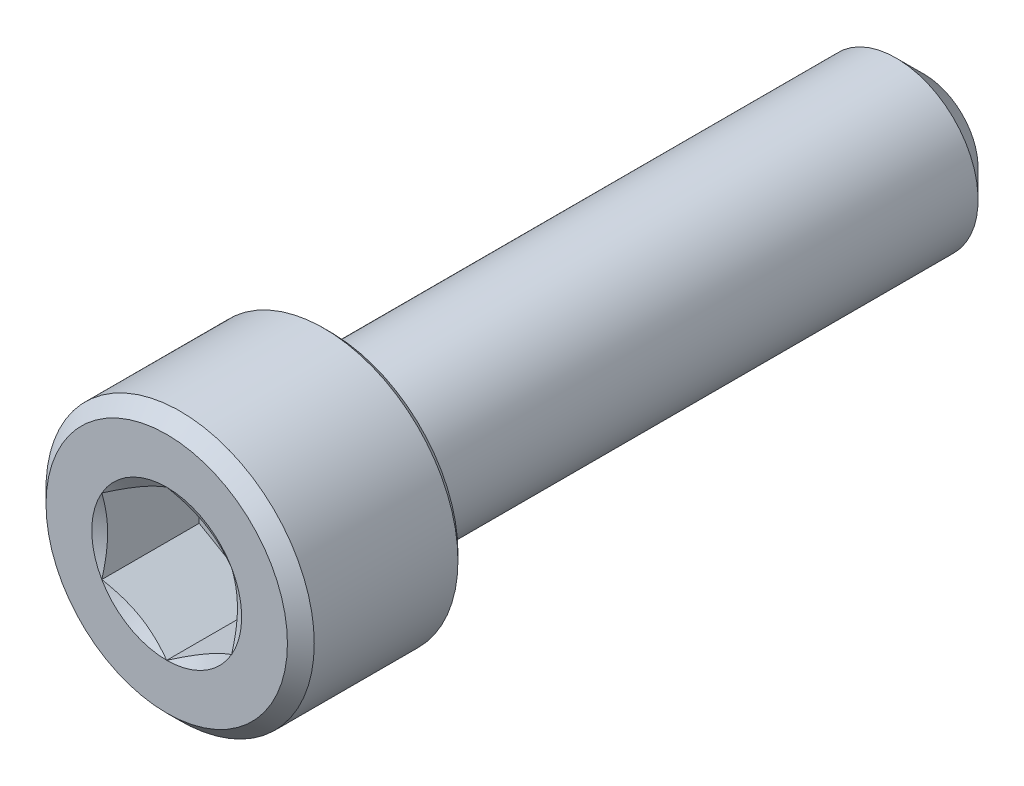
ISO-10303-21;
HEADER;
FILE_DESCRIPTION(('STEP AP214'),'2;1');
FILE_NAME('part.step','',(''),(''),'','','');
FILE_SCHEMA(('AUTOMOTIVE_DESIGN { 1 0 10303 214 1 1 1 1 }'));
ENDSEC;
DATA;
#1=APPLICATION_CONTEXT('core data for automotive mechanical design processes');
#2=APPLICATION_PROTOCOL_DEFINITION('international standard','automotive_design',2000,#1);
#3=PRODUCT_CONTEXT('',#1,'mechanical');
#4=PRODUCT('Part','Part','',(#3));
#5=PRODUCT_RELATED_PRODUCT_CATEGORY('part','',(#4));
#6=PRODUCT_DEFINITION_FORMATION('','',#4);
#7=PRODUCT_DEFINITION_CONTEXT('part definition',#1,'design');
#8=PRODUCT_DEFINITION('design','',#6,#7);
#9=PRODUCT_DEFINITION_SHAPE('','',#8);
#10=(LENGTH_UNIT() NAMED_UNIT(*) SI_UNIT(.MILLI.,.METRE.));
#11=(NAMED_UNIT(*) PLANE_ANGLE_UNIT() SI_UNIT($,.RADIAN.));
#12=(NAMED_UNIT(*) SI_UNIT($,.STERADIAN.) SOLID_ANGLE_UNIT());
#13=UNCERTAINTY_MEASURE_WITH_UNIT(LENGTH_MEASURE(1.E-05),#10,'distance_accuracy_value','');
#14=(GEOMETRIC_REPRESENTATION_CONTEXT(3) GLOBAL_UNCERTAINTY_ASSIGNED_CONTEXT((#13)) GLOBAL_UNIT_ASSIGNED_CONTEXT((#10,
#11,#12)) REPRESENTATION_CONTEXT('',''));
#15=CARTESIAN_POINT('',(0.,0.,0.));
#16=DIRECTION('',(0.,0.,1.));
#17=DIRECTION('',(1.,0.,0.));
#18=AXIS2_PLACEMENT_3D('',#15,#16,#17);
#19=CARTESIAN_POINT('',(0.,2.8702,8.1026));
#20=DIRECTION('',(0.,0.,1.));
#21=DIRECTION('',(1.,0.,0.));
#22=AXIS2_PLACEMENT_3D('',#19,#20,#21);
#23=PLANE('',#22);
#24=CARTESIAN_POINT('',(0.,0.,8.1026));
#25=DIRECTION('',(0.,0.,1.));
#26=DIRECTION('',(1.,0.,0.));
#27=AXIS2_PLACEMENT_3D('',#24,#25,#26);
#28=CIRCLE('',#27,2.58318);
#29=CARTESIAN_POINT('',(2.58318,0.,8.1026));
#30=VERTEX_POINT('',#29);
#31=EDGE_CURVE('E169',#30,#30,#28,.T.);
#32=ORIENTED_EDGE('',*,*,#31,.T.);
#33=EDGE_LOOP('',(#32));
#34=FACE_BOUND('',#33,.T.);
#35=CARTESIAN_POINT('',(0.,0.,8.1026));
#36=DIRECTION('',(0.,0.,1.));
#37=DIRECTION('',(1.,0.,0.));
#38=AXIS2_PLACEMENT_3D('',#35,#36,#37);
#39=CIRCLE('',#38,1.60395121659243);
#40=CARTESIAN_POINT('',(1.3890625,0.801975608296212,8.1026));
#41=VERTEX_POINT('',#40);
#42=CARTESIAN_POINT('',(0.,1.60395121659243,8.1026));
#43=VERTEX_POINT('',#42);
#44=EDGE_CURVE('E87',#41,#43,#39,.T.);
#45=ORIENTED_EDGE('',*,*,#44,.F.);
#46=CARTESIAN_POINT('',(1.3890625,-0.801975608296215,8.1026));
#47=VERTEX_POINT('',#46);
#48=EDGE_CURVE('E47',#47,#41,#39,.T.);
#49=ORIENTED_EDGE('',*,*,#48,.F.);
#50=CARTESIAN_POINT('',(0.,-1.60395121659243,8.1026));
#51=VERTEX_POINT('',#50);
#52=EDGE_CURVE('E274',#51,#47,#39,.T.);
#53=ORIENTED_EDGE('',*,*,#52,.F.);
#54=CARTESIAN_POINT('',(-1.3890625,-0.801975608296218,8.1026));
#55=VERTEX_POINT('',#54);
#56=EDGE_CURVE('E54',#55,#51,#39,.T.);
#57=ORIENTED_EDGE('',*,*,#56,.F.);
#58=CARTESIAN_POINT('',(-1.3890625,0.801975608296215,8.1026));
#59=VERTEX_POINT('',#58);
#60=EDGE_CURVE('E127',#59,#55,#39,.T.);
#61=ORIENTED_EDGE('',*,*,#60,.F.);
#62=EDGE_CURVE('E96',#43,#59,#39,.T.);
#63=ORIENTED_EDGE('',*,*,#62,.F.);
#64=EDGE_LOOP('',(#45,#49,#53,#57,#61,#63));
#65=FACE_BOUND('',#64,.T.);
#66=ADVANCED_FACE('F33',(#34,#65),#23,.T.);
#67=CARTESIAN_POINT('',(0.,0.,-8.1026));
#68=DIRECTION('',(0.,0.,-1.));
#69=DIRECTION('',(-1.,0.,0.));
#70=AXIS2_PLACEMENT_3D('',#67,#68,#69);
#71=CYLINDRICAL_SURFACE('',#70,2.8702);
#72=CARTESIAN_POINT('',(0.,0.,4.74091));
#73=DIRECTION('',(0.,0.,-1.));
#74=DIRECTION('',(-1.,0.,0.));
#75=AXIS2_PLACEMENT_3D('',#72,#73,#74);
#76=CIRCLE('',#75,2.8702);
#77=CARTESIAN_POINT('',(2.8702,0.,4.74091));
#78=VERTEX_POINT('',#77);
#79=EDGE_CURVE('E11',#78,#78,#76,.F.);
#80=ORIENTED_EDGE('',*,*,#79,.T.);
#81=EDGE_LOOP('',(#80));
#82=FACE_BOUND('',#81,.T.);
#83=CARTESIAN_POINT('',(0.,0.,7.81558));
#84=DIRECTION('',(0.,0.,1.));
#85=DIRECTION('',(1.,0.,0.));
#86=AXIS2_PLACEMENT_3D('',#83,#84,#85);
#87=CIRCLE('',#86,2.8702);
#88=CARTESIAN_POINT('',(2.8702,0.,7.81558));
#89=VERTEX_POINT('',#88);
#90=EDGE_CURVE('E106',#89,#89,#87,.F.);
#91=ORIENTED_EDGE('',*,*,#90,.T.);
#92=EDGE_LOOP('',(#91));
#93=FACE_BOUND('',#92,.T.);
#94=ADVANCED_FACE('F186',(#82,#93),#71,.T.);
#95=CARTESIAN_POINT('',(0.,2.8702,4.5974));
#96=DIRECTION('',(0.,0.,-1.));
#97=DIRECTION('',(-1.,0.,0.));
#98=AXIS2_PLACEMENT_3D('',#95,#96,#97);
#99=PLANE('',#98);
#100=CARTESIAN_POINT('',(0.,0.,4.5974));
#101=DIRECTION('',(0.,0.,-1.));
#102=DIRECTION('',(-1.,0.,0.));
#103=AXIS2_PLACEMENT_3D('',#100,#101,#102);
#104=CIRCLE('',#103,2.72668999999999);
#105=CARTESIAN_POINT('',(2.72668999999999,0.,4.5974));
#106=VERTEX_POINT('',#105);
#107=EDGE_CURVE('E41',#106,#106,#104,.T.);
#108=ORIENTED_EDGE('',*,*,#107,.T.);
#109=EDGE_LOOP('',(#108));
#110=FACE_BOUND('',#109,.T.);
#111=CARTESIAN_POINT('',(0.,0.,4.5974));
#112=DIRECTION('',(0.,0.,-1.));
#113=DIRECTION('',(-1.,0.,0.));
#114=AXIS2_PLACEMENT_3D('',#111,#112,#113);
#115=CIRCLE('',#114,1.7526);
#116=CARTESIAN_POINT('',(-1.7526,0.,4.5974));
#117=VERTEX_POINT('',#116);
#118=EDGE_CURVE('E107',#117,#117,#115,.T.);
#119=ORIENTED_EDGE('',*,*,#118,.F.);
#120=EDGE_LOOP('',(#119));
#121=FACE_BOUND('',#120,.T.);
#122=ADVANCED_FACE('F174',(#110,#121),#99,.T.);
#123=CARTESIAN_POINT('',(0.,0.,-8.1026));
#124=DIRECTION('',(0.,0.,-1.));
#125=DIRECTION('',(-1.,0.,0.));
#126=AXIS2_PLACEMENT_3D('',#123,#124,#125);
#127=CYLINDRICAL_SURFACE('',#126,1.7526);
#128=ORIENTED_EDGE('',*,*,#118,.T.);
#129=EDGE_LOOP('',(#128));
#130=FACE_BOUND('',#129,.T.);
#131=CARTESIAN_POINT('',(0.,0.,-7.5072875));
#132=DIRECTION('',(0.,0.,-1.));
#133=DIRECTION('',(-1.,0.,0.));
#134=AXIS2_PLACEMENT_3D('',#131,#132,#133);
#135=CIRCLE('',#134,1.7526);
#136=CARTESIAN_POINT('',(-1.7526,0.,-7.5072875));
#137=VERTEX_POINT('',#136);
#138=EDGE_CURVE('E215',#137,#137,#135,.T.);
#139=ORIENTED_EDGE('',*,*,#138,.F.);
#140=EDGE_LOOP('',(#139));
#141=FACE_BOUND('',#140,.T.);
#142=ADVANCED_FACE('F197',(#130,#141),#127,.T.);
#143=CARTESIAN_POINT('',(0.,0.,-8.1026));
#144=DIRECTION('',(0.,0.,1.));
#145=DIRECTION('',(1.,0.,0.));
#146=AXIS2_PLACEMENT_3D('',#143,#144,#145);
#147=CONICAL_SURFACE('',#146,1.1572875,0.785398163397443);
#148=ORIENTED_EDGE('',*,*,#138,.T.);
#149=EDGE_LOOP('',(#148));
#150=FACE_BOUND('',#149,.T.);
#151=CARTESIAN_POINT('',(0.,0.,-8.1026));
#152=DIRECTION('',(0.,0.,-1.));
#153=DIRECTION('',(-1.,0.,0.));
#154=AXIS2_PLACEMENT_3D('',#151,#152,#153);
#155=CIRCLE('',#154,1.1572875);
#156=CARTESIAN_POINT('',(-1.1572875,0.,-8.1026));
#157=VERTEX_POINT('',#156);
#158=EDGE_CURVE('E213',#157,#157,#155,.T.);
#159=ORIENTED_EDGE('',*,*,#158,.F.);
#160=EDGE_LOOP('',(#159));
#161=FACE_BOUND('',#160,.T.);
#162=ADVANCED_FACE('F200',(#150,#161),#147,.T.);
#163=CARTESIAN_POINT('',(0.,1.1572875,-8.1026));
#164=DIRECTION('',(0.,0.,-1.));
#165=DIRECTION('',(-1.,0.,0.));
#166=AXIS2_PLACEMENT_3D('',#163,#164,#165);
#167=PLANE('',#166);
#168=ORIENTED_EDGE('',*,*,#158,.T.);
#169=EDGE_LOOP('',(#168));
#170=FACE_BOUND('',#169,.T.);
#171=ADVANCED_FACE('F203',(#170),#167,.T.);
#172=CARTESIAN_POINT('',(0.,0.,8.1026));
#173=DIRECTION('',(0.,0.,1.));
#174=DIRECTION('',(1.,0.,0.));
#175=AXIS2_PLACEMENT_3D('',#172,#173,#174);
#176=CONICAL_SURFACE('',#175,1.60395121659243,1.0471975511966);
#177=ORIENTED_EDGE('',*,*,#62,.T.);
#178=CARTESIAN_POINT('',(0.000199999999999313,1.60406668664627,8.10266667386525));
#179=CARTESIAN_POINT('',(-0.0608442598690744,1.56882276677837,8.08230833857433));
#180=CARTESIAN_POINT('',(-0.122415445452366,1.53327462620754,8.0637926618312));
#181=CARTESIAN_POINT('',(-0.246624155605557,1.4615626939649,8.03147218472764));
#182=CARTESIAN_POINT('',(-0.309263888443662,1.42539762734885,8.01767882019906));
#183=CARTESIAN_POINT('',(-0.433766989921787,1.35351572819551,7.99620582768478));
#184=CARTESIAN_POINT('',(-0.495611193785563,1.31780996044694,7.98838331289986));
#185=CARTESIAN_POINT('',(-0.619590843813121,1.2462302761295,7.97904206929091));
#186=CARTESIAN_POINT('',(-0.681725838849018,1.21035662001942,7.97751560806186));
#187=CARTESIAN_POINT('',(-0.797844772079228,1.14331532266095,7.98067825862487));
#188=CARTESIAN_POINT('',(-0.851846025654005,1.11213768437298,7.98459082852922));
#189=CARTESIAN_POINT('',(-0.959496687442052,1.04998554581121,7.99699539372162));
#190=CARTESIAN_POINT('',(-1.01314572285493,1.01901126077382,8.00549163315096));
#191=CARTESIAN_POINT('',(-1.1210186357574,0.956730805471307,8.02673315397272));
#192=CARTESIAN_POINT('',(-1.17522884873762,0.92543252441435,8.0395685459783));
#193=CARTESIAN_POINT('',(-1.28284038683134,0.863302973928032,8.0687004444726));
#194=CARTESIAN_POINT('',(-1.33624309237207,0.832470907508634,8.08499009865837));
#195=CARTESIAN_POINT('',(-1.3892625,0.801860138242376,8.10266667386525));
#196=B_SPLINE_CURVE_WITH_KNOTS('',3,(#178,#179,#180,#181,#182,#183,#184,#185,#186,#187,#188,
#189,#190,#191,#192,#193,#194,#195),.UNSPECIFIED.,.F.,.F.,(4,2,2,2,2,2,2,2,4),(0.,
0.220193340404853,0.440916203543968,0.656175317558365,0.87116998541587,1.05842536263795,
1.24585442291107,1.43744291582434,1.62865484718206),.UNSPECIFIED.);
#197=EDGE_CURVE('E101',#43,#59,#196,.T.);
#198=ORIENTED_EDGE('',*,*,#197,.F.);
#199=EDGE_LOOP('',(#177,#198));
#200=FACE_BOUND('',#199,.T.);
#201=ADVANCED_FACE('F102',(#200),#176,.F.);
#202=ORIENTED_EDGE('',*,*,#60,.T.);
#203=CARTESIAN_POINT('',(-1.3890625,-2.07685002024154,8.61910245576466));
#204=CARTESIAN_POINT('',(-1.3890625,-2.01686543526765,8.59032411178202));
#205=CARTESIAN_POINT('',(-1.3890625,-1.95673484303842,8.56184475619254));
#206=CARTESIAN_POINT('',(-1.3890625,-1.83610351402459,8.50565344287182));
#207=CARTESIAN_POINT('',(-1.3890625,-1.77560271298754,8.47794162324606));
#208=CARTESIAN_POINT('',(-1.3890625,-1.6538059414698,8.42329998978084));
#209=CARTESIAN_POINT('',(-1.3890625,-1.5925073736981,8.39637593932212));
#210=CARTESIAN_POINT('',(-1.3890625,-1.46939685735004,8.34373577242147));
#211=CARTESIAN_POINT('',(-1.3890625,-1.40758493566438,8.31801959317222));
#212=CARTESIAN_POINT('',(-1.3890625,-1.28171667372201,8.26745906410609));
#213=CARTESIAN_POINT('',(-1.3890625,-1.21764390130113,8.24265507773206));
#214=CARTESIAN_POINT('',(-1.3890625,-1.08873727898944,8.19511764894136));
#215=CARTESIAN_POINT('',(-1.3890625,-1.02390333487632,8.17238446597768));
#216=CARTESIAN_POINT('',(-1.3890625,-0.828365227222706,8.10824985920816));
#217=CARTESIAN_POINT('',(-1.3890625,-0.696266953912143,8.07076292642813));
#218=CARTESIAN_POINT('',(-1.3890625,-0.495476464237932,8.02727992708727));
#219=CARTESIAN_POINT('',(-1.3890625,-0.428169848083489,8.01491577486165));
#220=CARTESIAN_POINT('',(-1.3890625,-0.292799475419255,7.99528420083069));
#221=CARTESIAN_POINT('',(-1.3890625,-0.224735770390863,7.98801643460182));
#222=CARTESIAN_POINT('',(-1.3890625,-0.0890471815727352,7.97924989543311));
#223=CARTESIAN_POINT('',(-1.3890625,-0.0214268110971385,7.97768304428555));
#224=CARTESIAN_POINT('',(-1.3890625,0.113702247349904,7.98026936378919));
#225=CARTESIAN_POINT('',(-1.3890625,0.1812109281468,7.98442288862569));
#226=CARTESIAN_POINT('',(-1.3890625,0.347778577027381,8.00136293367803));
#227=CARTESIAN_POINT('',(-1.3890625,0.446514758512839,8.01732406238986));
#228=CARTESIAN_POINT('',(-1.3890625,0.64206707876965,8.05848320798021));
#229=CARTESIAN_POINT('',(-1.3890625,0.738880754564212,8.08369235752521));
#230=CARTESIAN_POINT('',(-1.3890625,0.883676252165903,8.12675574532914));
#231=CARTESIAN_POINT('',(-1.3890625,0.932406539340782,8.14218599776802));
#232=CARTESIAN_POINT('',(-1.3890625,1.02935986306237,8.1744738893671));
#233=CARTESIAN_POINT('',(-1.3890625,1.07758319533807,8.19133063772775));
#234=CARTESIAN_POINT('',(-1.3890625,1.17358705289876,8.22622671160332));
#235=CARTESIAN_POINT('',(-1.3890625,1.22136765686518,8.24426582220311));
#236=CARTESIAN_POINT('',(-1.3890625,1.31655236991564,8.28133149862971));
#237=CARTESIAN_POINT('',(-1.3890625,1.36395641381943,8.30035823129092));
#238=CARTESIAN_POINT('',(-1.3890625,1.48495730251059,8.35014361077458));
#239=CARTESIAN_POINT('',(-1.3890625,1.55831219962691,8.38148967078271));
#240=CARTESIAN_POINT('',(-1.3890625,1.70435957234895,8.44569285386705));
#241=CARTESIAN_POINT('',(-1.3890625,1.7770519978395,8.47855009014349));
#242=CARTESIAN_POINT('',(-1.3890625,1.99435630092293,8.57885585607116));
#243=CARTESIAN_POINT('',(-1.3890625,2.138170932071,8.64802815945986));
#244=CARTESIAN_POINT('',(-1.3890625,2.42457153881605,8.78927384083221));
#245=CARTESIAN_POINT('',(-1.3890625,2.56715578662982,8.86135068069145));
#246=CARTESIAN_POINT('',(-1.3890625,2.85134737573814,9.00735768747072));
#247=CARTESIAN_POINT('',(-1.3890625,2.99295483831819,9.08128761881438));
#248=CARTESIAN_POINT('',(-1.3890625,3.26215970813908,9.22338588002099));
#249=CARTESIAN_POINT('',(-1.3890625,3.38981792660024,9.29143940288634));
#250=CARTESIAN_POINT('',(-1.3890625,3.64472372522021,9.42832184769865));
#251=CARTESIAN_POINT('',(-1.3890625,3.77197128995666,9.49715079834119));
#252=CARTESIAN_POINT('',(-1.3890625,4.02582678691827,9.63521383492683));
#253=CARTESIAN_POINT('',(-1.3890625,4.15243552283408,9.70444644510381));
#254=CARTESIAN_POINT('',(-1.3890625,4.40539702257176,9.84336226845954));
#255=CARTESIAN_POINT('',(-1.3890625,4.53174979944255,9.91304545786754));
#256=CARTESIAN_POINT('',(-1.3890625,4.65801061606865,9.98289387565623));
#257=B_SPLINE_CURVE_WITH_KNOTS('',3,(#203,#204,#205,#206,#207,#208,#209,#210,#211,#212,#213,
#214,#215,#216,#217,#218,#219,#220,#221,#222,#223,#224,#225,#226,#227,#228,#229,#230,#231,#232,
#233,#234,#235,#236,#237,#238,#239,#240,#241,#242,#243,#244,#245,#246,#247,#248,#249,#250,#251,
#252,#253,#254,#255,#256),.UNSPECIFIED.,.F.,.F.,(4,2,2,2,2,2,2,2,2,2,2,2,2,2,2,2,2,2,2,2,2,2,2,
2,2,2,4),(0.,0.199594864558618,0.399225412638609,0.600066926702136,0.800897985745749,
1.00697894686825,1.21308569266494,1.62413648747808,1.82927923592425,2.0344081190938,
2.23707923776963,2.43976290568286,2.73920122123377,3.03900118655649,3.19232901808457,
3.34556179818686,3.49876680236775,3.65199777152096,3.89128805090402,4.13059628449635,
4.60929179357835,5.08857578343221,5.56779914972328,6.00179049964822,6.43579796300831,
6.86870151515838,7.30158241240357),.UNSPECIFIED.);
#258=EDGE_CURVE('E95',#59,#55,#257,.F.);
#259=ORIENTED_EDGE('',*,*,#258,.F.);
#260=EDGE_LOOP('',(#202,#259));
#261=FACE_BOUND('',#260,.T.);
#262=ADVANCED_FACE('F210',(#261),#176,.F.);
#263=ORIENTED_EDGE('',*,*,#56,.T.);
#264=CARTESIAN_POINT('',(-1.3892625,-0.801860138242377,8.10266667386525));
#265=CARTESIAN_POINT('',(-1.32821824013093,-0.837104058110269,8.08230833857433));
#266=CARTESIAN_POINT('',(-1.26664705454763,-0.872652198681106,8.0637926618312));
#267=CARTESIAN_POINT('',(-1.14243834439444,-0.944364130923747,8.03147218472763));
#268=CARTESIAN_POINT('',(-1.07979861155634,-0.980529197539793,8.01767882019906));
#269=CARTESIAN_POINT('',(-0.955295510078214,-1.05241109669313,7.99620582768478));
#270=CARTESIAN_POINT('',(-0.893451306214438,-1.0881168644417,7.98838331289986));
#271=CARTESIAN_POINT('',(-0.76947165618688,-1.15969654875915,7.9790420692909));
#272=CARTESIAN_POINT('',(-0.707336661150983,-1.19557020486922,7.97751560806186));
#273=CARTESIAN_POINT('',(-0.591217727920773,-1.26261150222769,7.98067825862487));
#274=CARTESIAN_POINT('',(-0.537216474345996,-1.29378914051567,7.98459082852922));
#275=CARTESIAN_POINT('',(-0.429565812557949,-1.35594127907744,7.99699539372161));
#276=CARTESIAN_POINT('',(-0.375916777145072,-1.38691556411482,8.00549163315096));
#277=CARTESIAN_POINT('',(-0.268043864242602,-1.44919601941734,8.02673315397271));
#278=CARTESIAN_POINT('',(-0.213833651262382,-1.48049430047429,8.0395685459783));
#279=CARTESIAN_POINT('',(-0.106222113168662,-1.54262385096061,8.0687004444726));
#280=CARTESIAN_POINT('',(-0.0528194076279263,-1.57345591738001,8.08499009865837));
#281=CARTESIAN_POINT('',(0.000200000000000496,-1.60406668664627,8.10266667386524));
#282=B_SPLINE_CURVE_WITH_KNOTS('',3,(#264,#265,#266,#267,#268,#269,#270,#271,#272,#273,#274,
#275,#276,#277,#278,#279,#280,#281),.UNSPECIFIED.,.F.,.F.,(4,2,2,2,2,2,2,2,4),(0.,
0.220193340404853,0.440916203543968,0.656175317558364,0.871169985415868,1.05842536263795,
1.24585442291107,1.43744291582434,1.62865484718206),.UNSPECIFIED.);
#283=EDGE_CURVE('E137',#55,#51,#282,.T.);
#284=ORIENTED_EDGE('',*,*,#283,.F.);
#285=EDGE_LOOP('',(#263,#284));
#286=FACE_BOUND('',#285,.T.);
#287=ADVANCED_FACE('F277',(#286),#176,.F.);
#288=ORIENTED_EDGE('',*,*,#52,.T.);
#289=CARTESIAN_POINT('',(-0.000199999999999428,-1.60406668664627,8.10266667386524));
#290=CARTESIAN_POINT('',(0.0608442598690745,-1.56882276677838,8.08230833857432));
#291=CARTESIAN_POINT('',(0.122415445452365,-1.53327462620754,8.06379266183119));
#292=CARTESIAN_POINT('',(0.246624155605556,-1.4615626939649,8.03147218472763));
#293=CARTESIAN_POINT('',(0.309263888443661,-1.42539762734885,8.01767882019906));
#294=CARTESIAN_POINT('',(0.433766989921786,-1.35351572819551,7.99620582768478));
#295=CARTESIAN_POINT('',(0.495611193785561,-1.31780996044694,7.98838331289986));
#296=CARTESIAN_POINT('',(0.619590843813119,-1.2462302761295,7.9790420692909));
#297=CARTESIAN_POINT('',(0.681725838849016,-1.21035662001943,7.97751560806186));
#298=CARTESIAN_POINT('',(0.797844772079226,-1.14331532266095,7.98067825862487));
#299=CARTESIAN_POINT('',(0.851846025654003,-1.11213768437298,7.98459082852922));
#300=CARTESIAN_POINT('',(0.95949668744205,-1.04998554581121,7.99699539372162));
#301=CARTESIAN_POINT('',(1.01314572285493,-1.01901126077382,8.00549163315096));
#302=CARTESIAN_POINT('',(1.1210186357574,-0.956730805471309,8.02673315397271));
#303=CARTESIAN_POINT('',(1.17522884873762,-0.925432524414352,8.0395685459783));
#304=CARTESIAN_POINT('',(1.28284038683134,-0.863302973928033,8.0687004444726));
#305=CARTESIAN_POINT('',(1.33624309237207,-0.832470907508635,8.08499009865837));
#306=CARTESIAN_POINT('',(1.3892625,-0.801860138242377,8.10266667386525));
#307=B_SPLINE_CURVE_WITH_KNOTS('',3,(#289,#290,#291,#292,#293,#294,#295,#296,#297,#298,#299,
#300,#301,#302,#303,#304,#305,#306),.UNSPECIFIED.,.F.,.F.,(4,2,2,2,2,2,2,2,4),(0.,
0.220193340404852,0.440916203543967,0.656175317558363,0.871169985415867,1.05842536263795,
1.24585442291107,1.43744291582434,1.62865484718206),.UNSPECIFIED.);
#308=EDGE_CURVE('E251',#51,#47,#307,.T.);
#309=ORIENTED_EDGE('',*,*,#308,.F.);
#310=EDGE_LOOP('',(#288,#309));
#311=FACE_BOUND('',#310,.T.);
#312=ADVANCED_FACE('F276',(#311),#176,.F.);
#313=ORIENTED_EDGE('',*,*,#48,.T.);
#314=CARTESIAN_POINT('',(1.3890625,-2.07685002024154,8.61910245576466));
#315=CARTESIAN_POINT('',(1.3890625,-2.01686543526765,8.59032411178202));
#316=CARTESIAN_POINT('',(1.3890625,-1.95673484303841,8.56184475619254));
#317=CARTESIAN_POINT('',(1.3890625,-1.83610351402458,8.50565344287182));
#318=CARTESIAN_POINT('',(1.3890625,-1.77560271298754,8.47794162324606));
#319=CARTESIAN_POINT('',(1.3890625,-1.6538059414698,8.42329998978084));
#320=CARTESIAN_POINT('',(1.3890625,-1.5925073736981,8.39637593932211));
#321=CARTESIAN_POINT('',(1.3890625,-1.46939685735004,8.34373577242147));
#322=CARTESIAN_POINT('',(1.3890625,-1.40758493566438,8.31801959317222));
#323=CARTESIAN_POINT('',(1.3890625,-1.28171667372201,8.26745906410609));
#324=CARTESIAN_POINT('',(1.3890625,-1.21764390130113,8.24265507773206));
#325=CARTESIAN_POINT('',(1.3890625,-1.08873727898944,8.19511764894136));
#326=CARTESIAN_POINT('',(1.3890625,-1.02390333487632,8.17238446597768));
#327=CARTESIAN_POINT('',(1.3890625,-0.828365227222705,8.10824985920816));
#328=CARTESIAN_POINT('',(1.3890625,-0.696266953912142,8.07076292642813));
#329=CARTESIAN_POINT('',(1.3890625,-0.495476464237931,8.02727992708727));
#330=CARTESIAN_POINT('',(1.3890625,-0.428169848083488,8.01491577486165));
#331=CARTESIAN_POINT('',(1.3890625,-0.292799475419254,7.99528420083069));
#332=CARTESIAN_POINT('',(1.3890625,-0.224735770390862,7.98801643460182));
#333=CARTESIAN_POINT('',(1.3890625,-0.0890471815727344,7.97924989543311));
#334=CARTESIAN_POINT('',(1.3890625,-0.0214268110971376,7.97768304428555));
#335=CARTESIAN_POINT('',(1.3890625,0.113702247349905,7.98026936378919));
#336=CARTESIAN_POINT('',(1.3890625,0.181210928146801,7.98442288862569));
#337=CARTESIAN_POINT('',(1.3890625,0.347778577027382,8.00136293367803));
#338=CARTESIAN_POINT('',(1.3890625,0.44651475851284,8.01732406238986));
#339=CARTESIAN_POINT('',(1.3890625,0.642067078769651,8.05848320798021));
#340=CARTESIAN_POINT('',(1.3890625,0.738880754564213,8.08369235752521));
#341=CARTESIAN_POINT('',(1.3890625,0.883676252165904,8.12675574532914));
#342=CARTESIAN_POINT('',(1.3890625,0.932406539340783,8.14218599776802));
#343=CARTESIAN_POINT('',(1.3890625,1.02935986306237,8.1744738893671));
#344=CARTESIAN_POINT('',(1.3890625,1.07758319533807,8.19133063772775));
#345=CARTESIAN_POINT('',(1.3890625,1.17358705289876,8.22622671160332));
#346=CARTESIAN_POINT('',(1.3890625,1.22136765686518,8.24426582220311));
#347=CARTESIAN_POINT('',(1.3890625,1.31655236991564,8.28133149862971));
#348=CARTESIAN_POINT('',(1.3890625,1.36395641381944,8.30035823129092));
#349=CARTESIAN_POINT('',(1.3890625,1.48495730251059,8.35014361077458));
#350=CARTESIAN_POINT('',(1.3890625,1.55831219962692,8.38148967078272));
#351=CARTESIAN_POINT('',(1.3890625,1.70435957234896,8.44569285386705));
#352=CARTESIAN_POINT('',(1.3890625,1.77705199783951,8.47855009014349));
#353=CARTESIAN_POINT('',(1.3890625,1.99435630092294,8.57885585607116));
#354=CARTESIAN_POINT('',(1.3890625,2.138170932071,8.64802815945986));
#355=CARTESIAN_POINT('',(1.3890625,2.42457153881605,8.78927384083221));
#356=CARTESIAN_POINT('',(1.3890625,2.56715578662982,8.86135068069145));
#357=CARTESIAN_POINT('',(1.3890625,2.85134737573814,9.00735768747072));
#358=CARTESIAN_POINT('',(1.3890625,2.99295483831819,9.08128761881438));
#359=CARTESIAN_POINT('',(1.3890625,3.26215970813909,9.223385880021));
#360=CARTESIAN_POINT('',(1.3890625,3.38981792660025,9.29143940288635));
#361=CARTESIAN_POINT('',(1.3890625,3.64472372522022,9.42832184769866));
#362=CARTESIAN_POINT('',(1.3890625,3.77197128995667,9.49715079834119));
#363=CARTESIAN_POINT('',(1.3890625,4.02582678691828,9.63521383492684));
#364=CARTESIAN_POINT('',(1.3890625,4.15243552283408,9.70444644510381));
#365=CARTESIAN_POINT('',(1.3890625,4.40539702257177,9.84336226845955));
#366=CARTESIAN_POINT('',(1.3890625,4.53174979944256,9.91304545786754));
#367=CARTESIAN_POINT('',(1.3890625,4.65801061606865,9.98289387565624));
#368=B_SPLINE_CURVE_WITH_KNOTS('',3,(#314,#315,#316,#317,#318,#319,#320,#321,#322,#323,#324,
#325,#326,#327,#328,#329,#330,#331,#332,#333,#334,#335,#336,#337,#338,#339,#340,#341,#342,#343,
#344,#345,#346,#347,#348,#349,#350,#351,#352,#353,#354,#355,#356,#357,#358,#359,#360,#361,#362,
#363,#364,#365,#366,#367),.UNSPECIFIED.,.F.,.F.,(4,2,2,2,2,2,2,2,2,2,2,2,2,2,2,2,2,2,2,2,2,2,2,
2,2,2,4),(0.,0.199594864558617,0.399225412638609,0.600066926702136,0.800897985745748,
1.00697894686825,1.21308569266494,1.62413648747807,1.82927923592425,2.0344081190938,
2.23707923776963,2.43976290568286,2.73920122123377,3.03900118655649,3.19232901808457,
3.34556179818686,3.49876680236775,3.65199777152096,3.89128805090402,4.13059628449635,
4.60929179357835,5.08857578343221,5.56779914972328,6.00179049964822,6.43579796300831,
6.86870151515839,7.30158241240357),.UNSPECIFIED.);
#369=EDGE_CURVE('E117',#47,#41,#368,.T.);
#370=ORIENTED_EDGE('',*,*,#369,.F.);
#371=EDGE_LOOP('',(#313,#370));
#372=FACE_BOUND('',#371,.T.);
#373=ADVANCED_FACE('F287',(#372),#176,.F.);
#374=ORIENTED_EDGE('',*,*,#44,.T.);
#375=CARTESIAN_POINT('',(1.3892625,0.801860138242376,8.10266667386525));
#376=CARTESIAN_POINT('',(1.32821824013093,0.837104058110268,8.08230833857433));
#377=CARTESIAN_POINT('',(1.26664705454763,0.872652198681105,8.0637926618312));
#378=CARTESIAN_POINT('',(1.14243834439444,0.944364130923746,8.03147218472764));
#379=CARTESIAN_POINT('',(1.07979861155634,0.980529197539793,8.01767882019906));
#380=CARTESIAN_POINT('',(0.955295510078213,1.05241109669313,7.99620582768478));
#381=CARTESIAN_POINT('',(0.893451306214437,1.0881168644417,7.98838331289986));
#382=CARTESIAN_POINT('',(0.769471656186879,1.15969654875915,7.97904206929091));
#383=CARTESIAN_POINT('',(0.707336661150982,1.19557020486922,7.97751560806186));
#384=CARTESIAN_POINT('',(0.591217727920772,1.26261150222769,7.98067825862487));
#385=CARTESIAN_POINT('',(0.537216474345995,1.29378914051567,7.98459082852922));
#386=CARTESIAN_POINT('',(0.429565812557948,1.35594127907744,7.99699539372162));
#387=CARTESIAN_POINT('',(0.375916777145071,1.38691556411482,8.00549163315096));
#388=CARTESIAN_POINT('',(0.268043864242601,1.44919601941733,8.02673315397272));
#389=CARTESIAN_POINT('',(0.213833651262381,1.48049430047429,8.0395685459783));
#390=CARTESIAN_POINT('',(0.106222113168662,1.54262385096061,8.0687004444726));
#391=CARTESIAN_POINT('',(0.0528194076279258,1.57345591738001,8.08499009865837));
#392=CARTESIAN_POINT('',(-0.000200000000000762,1.60406668664627,8.10266667386525));
#393=B_SPLINE_CURVE_WITH_KNOTS('',3,(#375,#376,#377,#378,#379,#380,#381,#382,#383,#384,#385,
#386,#387,#388,#389,#390,#391,#392),.UNSPECIFIED.,.F.,.F.,(4,2,2,2,2,2,2,2,4),(0.,
0.220193340404853,0.440916203543969,0.656175317558366,0.87116998541587,1.05842536263795,
1.24585442291107,1.43744291582434,1.62865484718206),.UNSPECIFIED.);
#394=EDGE_CURVE('E91',#41,#43,#393,.T.);
#395=ORIENTED_EDGE('',*,*,#394,.F.);
#396=EDGE_LOOP('',(#374,#395));
#397=FACE_BOUND('',#396,.T.);
#398=ADVANCED_FACE('F89',(#397),#176,.F.);
#399=CARTESIAN_POINT('',(0.,0.,6.01900625));
#400=DIRECTION('',(0.,0.,1.));
#401=DIRECTION('',(1.,0.,0.));
#402=AXIS2_PLACEMENT_3D('',#399,#400,#401);
#403=PLANE('',#402);
#404=DIRECTION('',(-0.866025403784439,0.5,0.));
#405=VECTOR('',#404,1.);
#406=CARTESIAN_POINT('',(1.3890625,0.801975608296214,6.01900625));
#407=LINE('',#406,#405);
#408=CARTESIAN_POINT('',(1.3890625,0.801975608296214,6.01900625));
#409=VERTEX_POINT('',#408);
#410=CARTESIAN_POINT('',(0.,1.60395121659243,6.01900625));
#411=VERTEX_POINT('',#410);
#412=EDGE_CURVE('E116',#409,#411,#407,.T.);
#413=ORIENTED_EDGE('',*,*,#412,.T.);
#414=DIRECTION('',(-0.866025403784439,-0.5,0.));
#415=VECTOR('',#414,1.);
#416=CARTESIAN_POINT('',(0.,1.60395121659243,6.01900625));
#417=LINE('',#416,#415);
#418=CARTESIAN_POINT('',(-1.3890625,0.801975608296214,6.01900625));
#419=VERTEX_POINT('',#418);
#420=EDGE_CURVE('E121',#411,#419,#417,.T.);
#421=ORIENTED_EDGE('',*,*,#420,.T.);
#422=DIRECTION('',(0.,-1.,0.));
#423=VECTOR('',#422,1.);
#424=CARTESIAN_POINT('',(-1.3890625,0.801975608296214,6.01900625));
#425=LINE('',#424,#423);
#426=CARTESIAN_POINT('',(-1.3890625,-0.801975608296215,6.01900625));
#427=VERTEX_POINT('',#426);
#428=EDGE_CURVE('E237',#419,#427,#425,.T.);
#429=ORIENTED_EDGE('',*,*,#428,.T.);
#430=DIRECTION('',(0.866025403784439,-0.5,0.));
#431=VECTOR('',#430,1.);
#432=CARTESIAN_POINT('',(-1.3890625,-0.801975608296215,6.01900625));
#433=LINE('',#432,#431);
#434=CARTESIAN_POINT('',(0.,-1.60395121659243,6.01900625));
#435=VERTEX_POINT('',#434);
#436=EDGE_CURVE('E234',#427,#435,#433,.T.);
#437=ORIENTED_EDGE('',*,*,#436,.T.);
#438=DIRECTION('',(0.866025403784438,0.5,0.));
#439=VECTOR('',#438,1.);
#440=CARTESIAN_POINT('',(0.,-1.60395121659243,6.01900625));
#441=LINE('',#440,#439);
#442=CARTESIAN_POINT('',(1.3890625,-0.801975608296215,6.01900625));
#443=VERTEX_POINT('',#442);
#444=EDGE_CURVE('E231',#435,#443,#441,.T.);
#445=ORIENTED_EDGE('',*,*,#444,.T.);
#446=DIRECTION('',(0.,1.,0.));
#447=VECTOR('',#446,1.);
#448=CARTESIAN_POINT('',(1.3890625,-0.801975608296215,6.01900625));
#449=LINE('',#448,#447);
#450=EDGE_CURVE('E124',#443,#409,#449,.T.);
#451=ORIENTED_EDGE('',*,*,#450,.T.);
#452=EDGE_LOOP('',(#413,#421,#429,#437,#445,#451));
#453=FACE_BOUND('',#452,.T.);
#454=ADVANCED_FACE('F157',(#453),#403,.T.);
#455=CARTESIAN_POINT('',(0.,1.60395121659243,6.01900625));
#456=DIRECTION('',(-0.5,0.866025403784439,0.));
#457=DIRECTION('',(-0.866025403784439,-0.5,0.));
#458=AXIS2_PLACEMENT_3D('',#455,#456,#457);
#459=PLANE('',#458);
#460=DIRECTION('',(0.,0.,1.));
#461=VECTOR('',#460,1.);
#462=CARTESIAN_POINT('',(0.,1.60395121659243,6.01900625));
#463=LINE('',#462,#461);
#464=EDGE_CURVE('E113',#411,#43,#463,.T.);
#465=ORIENTED_EDGE('',*,*,#464,.T.);
#466=ORIENTED_EDGE('',*,*,#197,.T.);
#467=DIRECTION('',(0.,0.,1.));
#468=VECTOR('',#467,1.);
#469=CARTESIAN_POINT('',(-1.3890625,0.801975608296214,6.01900625));
#470=LINE('',#469,#468);
#471=EDGE_CURVE('E123',#419,#59,#470,.T.);
#472=ORIENTED_EDGE('',*,*,#471,.F.);
#473=ORIENTED_EDGE('',*,*,#420,.F.);
#474=EDGE_LOOP('',(#465,#466,#472,#473));
#475=FACE_BOUND('',#474,.T.);
#476=ADVANCED_FACE('F119',(#475),#459,.F.);
#477=CARTESIAN_POINT('',(-1.3890625,0.801975608296214,6.01900625));
#478=DIRECTION('',(-1.,0.,0.));
#479=DIRECTION('',(0.,0.,1.));
#480=AXIS2_PLACEMENT_3D('',#477,#478,#479);
#481=PLANE('',#480);
#482=ORIENTED_EDGE('',*,*,#471,.T.);
#483=ORIENTED_EDGE('',*,*,#258,.T.);
#484=DIRECTION('',(0.,0.,1.));
#485=VECTOR('',#484,1.);
#486=CARTESIAN_POINT('',(-1.3890625,-0.801975608296215,6.01900625));
#487=LINE('',#486,#485);
#488=EDGE_CURVE('E222',#427,#55,#487,.T.);
#489=ORIENTED_EDGE('',*,*,#488,.F.);
#490=ORIENTED_EDGE('',*,*,#428,.F.);
#491=EDGE_LOOP('',(#482,#483,#489,#490));
#492=FACE_BOUND('',#491,.T.);
#493=ADVANCED_FACE('F146',(#492),#481,.F.);
#494=CARTESIAN_POINT('',(-1.3890625,-0.801975608296215,6.01900625));
#495=DIRECTION('',(-0.5,-0.866025403784439,0.));
#496=DIRECTION('',(0.866025403784439,-0.5,0.));
#497=AXIS2_PLACEMENT_3D('',#494,#495,#496);
#498=PLANE('',#497);
#499=ORIENTED_EDGE('',*,*,#488,.T.);
#500=ORIENTED_EDGE('',*,*,#283,.T.);
#501=DIRECTION('',(0.,0.,1.));
#502=VECTOR('',#501,1.);
#503=CARTESIAN_POINT('',(0.,-1.60395121659243,6.01900625));
#504=LINE('',#503,#502);
#505=EDGE_CURVE('E225',#435,#51,#504,.T.);
#506=ORIENTED_EDGE('',*,*,#505,.F.);
#507=ORIENTED_EDGE('',*,*,#436,.F.);
#508=EDGE_LOOP('',(#499,#500,#506,#507));
#509=FACE_BOUND('',#508,.T.);
#510=ADVANCED_FACE('F150',(#509),#498,.F.);
#511=CARTESIAN_POINT('',(0.,-1.60395121659243,6.01900625));
#512=DIRECTION('',(0.5,-0.866025403784439,0.));
#513=DIRECTION('',(0.866025403784438,0.5,0.));
#514=AXIS2_PLACEMENT_3D('',#511,#512,#513);
#515=PLANE('',#514);
#516=ORIENTED_EDGE('',*,*,#505,.T.);
#517=ORIENTED_EDGE('',*,*,#308,.T.);
#518=DIRECTION('',(0.,0.,1.));
#519=VECTOR('',#518,1.);
#520=CARTESIAN_POINT('',(1.3890625,-0.801975608296215,6.01900625));
#521=LINE('',#520,#519);
#522=EDGE_CURVE('E218',#443,#47,#521,.T.);
#523=ORIENTED_EDGE('',*,*,#522,.F.);
#524=ORIENTED_EDGE('',*,*,#444,.F.);
#525=EDGE_LOOP('',(#516,#517,#523,#524));
#526=FACE_BOUND('',#525,.T.);
#527=ADVANCED_FACE('F259',(#526),#515,.F.);
#528=CARTESIAN_POINT('',(1.3890625,-0.801975608296215,6.01900625));
#529=DIRECTION('',(1.,0.,0.));
#530=DIRECTION('',(0.,0.,-1.));
#531=AXIS2_PLACEMENT_3D('',#528,#529,#530);
#532=PLANE('',#531);
#533=ORIENTED_EDGE('',*,*,#522,.T.);
#534=ORIENTED_EDGE('',*,*,#369,.T.);
#535=DIRECTION('',(0.,0.,1.));
#536=VECTOR('',#535,1.);
#537=CARTESIAN_POINT('',(1.3890625,0.801975608296214,6.01900625));
#538=LINE('',#537,#536);
#539=EDGE_CURVE('E115',#409,#41,#538,.T.);
#540=ORIENTED_EDGE('',*,*,#539,.F.);
#541=ORIENTED_EDGE('',*,*,#450,.F.);
#542=EDGE_LOOP('',(#533,#534,#540,#541));
#543=FACE_BOUND('',#542,.T.);
#544=ADVANCED_FACE('F256',(#543),#532,.F.);
#545=CARTESIAN_POINT('',(1.3890625,0.801975608296214,6.01900625));
#546=DIRECTION('',(0.499999999999999,0.866025403784439,0.));
#547=DIRECTION('',(-0.866025403784439,0.5,0.));
#548=AXIS2_PLACEMENT_3D('',#545,#546,#547);
#549=PLANE('',#548);
#550=ORIENTED_EDGE('',*,*,#539,.T.);
#551=ORIENTED_EDGE('',*,*,#394,.T.);
#552=ORIENTED_EDGE('',*,*,#464,.F.);
#553=ORIENTED_EDGE('',*,*,#412,.F.);
#554=EDGE_LOOP('',(#550,#551,#552,#553));
#555=FACE_BOUND('',#554,.T.);
#556=ADVANCED_FACE('F111',(#555),#549,.F.);
#557=CARTESIAN_POINT('',(0.,0.,7.81558));
#558=DIRECTION('',(0.,0.,-1.));
#559=DIRECTION('',(-1.,0.,0.));
#560=AXIS2_PLACEMENT_3D('',#557,#558,#559);
#561=CONICAL_SURFACE('',#560,2.8702,0.785398163397454);
#562=ORIENTED_EDGE('',*,*,#31,.F.);
#563=EDGE_LOOP('',(#562));
#564=FACE_BOUND('',#563,.T.);
#565=ORIENTED_EDGE('',*,*,#90,.F.);
#566=EDGE_LOOP('',(#565));
#567=FACE_BOUND('',#566,.T.);
#568=ADVANCED_FACE('F178',(#564,#567),#561,.T.);
#569=CARTESIAN_POINT('',(0.,0.,4.5974));
#570=DIRECTION('',(0.,0.,1.));
#571=DIRECTION('',(1.,0.,0.));
#572=AXIS2_PLACEMENT_3D('',#569,#570,#571);
#573=CONICAL_SURFACE('',#572,2.72668999999999,0.78539816339745);
#574=CARTESIAN_POINT('',(2.8702,0.,4.74091));
#575=CARTESIAN_POINT('',(2.86870510416667,0.,4.73941510416667));
#576=CARTESIAN_POINT('',(2.86721020833333,0.,4.73792020833334));
#577=CARTESIAN_POINT('',(2.86422041666667,0.,4.73493041666667));
#578=CARTESIAN_POINT('',(2.86272552083333,0.,4.73343552083334));
#579=CARTESIAN_POINT('',(2.85973572916667,0.,4.73044572916667));
#580=CARTESIAN_POINT('',(2.85824083333333,0.,4.72895083333334));
#581=CARTESIAN_POINT('',(2.85525104166667,0.,4.72596104166667));
#582=CARTESIAN_POINT('',(2.85375614583333,0.,4.72446614583334));
#583=CARTESIAN_POINT('',(2.85076635416666,0.,4.72147635416667));
#584=CARTESIAN_POINT('',(2.84927145833333,0.,4.71998145833334));
#585=CARTESIAN_POINT('',(2.84628166666666,0.,4.71699166666667));
#586=CARTESIAN_POINT('',(2.84478677083333,0.,4.71549677083333));
#587=CARTESIAN_POINT('',(2.84179697916666,0.,4.71250697916667));
#588=CARTESIAN_POINT('',(2.84030208333333,0.,4.71101208333334));
#589=CARTESIAN_POINT('',(2.83731229166666,0.,4.70802229166667));
#590=CARTESIAN_POINT('',(2.83581739583333,0.,4.70652739583334));
#591=CARTESIAN_POINT('',(2.83282760416666,0.,4.70353760416667));
#592=CARTESIAN_POINT('',(2.83133270833333,0.,4.70204270833333));
#593=CARTESIAN_POINT('',(2.82834291666666,0.,4.69905291666667));
#594=CARTESIAN_POINT('',(2.82684802083333,0.,4.69755802083333));
#595=CARTESIAN_POINT('',(2.82385822916666,0.,4.69456822916667));
#596=CARTESIAN_POINT('',(2.82236333333333,0.,4.69307333333333));
#597=CARTESIAN_POINT('',(2.81937354166666,0.,4.69008354166667));
#598=CARTESIAN_POINT('',(2.81787864583333,0.,4.68858864583333));
#599=CARTESIAN_POINT('',(2.81488885416666,0.,4.68559885416667));
#600=CARTESIAN_POINT('',(2.81339395833333,0.,4.68410395833333));
#601=CARTESIAN_POINT('',(2.81040416666666,0.,4.68111416666667));
#602=CARTESIAN_POINT('',(2.80890927083333,0.,4.67961927083333));
#603=CARTESIAN_POINT('',(2.80591947916666,0.,4.67662947916667));
#604=CARTESIAN_POINT('',(2.80442458333333,0.,4.67513458333333));
#605=CARTESIAN_POINT('',(2.80143479166666,0.,4.67214479166667));
#606=CARTESIAN_POINT('',(2.79993989583333,0.,4.67064989583333));
#607=CARTESIAN_POINT('',(2.79695010416666,0.,4.66766010416667));
#608=CARTESIAN_POINT('',(2.79545520833333,0.,4.66616520833333));
#609=CARTESIAN_POINT('',(2.79246541666666,0.,4.66317541666667));
#610=CARTESIAN_POINT('',(2.79097052083333,0.,4.66168052083333));
#611=CARTESIAN_POINT('',(2.78798072916666,0.,4.65869072916667));
#612=CARTESIAN_POINT('',(2.78648583333333,0.,4.65719583333333));
#613=CARTESIAN_POINT('',(2.78349604166666,0.,4.65420604166667));
#614=CARTESIAN_POINT('',(2.78200114583333,0.,4.65271114583333));
#615=CARTESIAN_POINT('',(2.77901135416666,0.,4.64972135416667));
#616=CARTESIAN_POINT('',(2.77751645833333,0.,4.64822645833333));
#617=CARTESIAN_POINT('',(2.77452666666666,0.,4.64523666666667));
#618=CARTESIAN_POINT('',(2.77303177083333,0.,4.64374177083333));
#619=CARTESIAN_POINT('',(2.77004197916666,0.,4.64075197916667));
#620=CARTESIAN_POINT('',(2.76854708333333,0.,4.63925708333333));
#621=CARTESIAN_POINT('',(2.76555729166666,0.,4.63626729166667));
#622=CARTESIAN_POINT('',(2.76406239583333,0.,4.63477239583333));
#623=CARTESIAN_POINT('',(2.76107260416666,0.,4.63178260416667));
#624=CARTESIAN_POINT('',(2.75957770833333,0.,4.63028770833333));
#625=CARTESIAN_POINT('',(2.75658791666666,0.,4.62729791666667));
#626=CARTESIAN_POINT('',(2.75509302083333,0.,4.62580302083333));
#627=CARTESIAN_POINT('',(2.75210322916666,0.,4.62281322916667));
#628=CARTESIAN_POINT('',(2.75060833333333,0.,4.62131833333333));
#629=CARTESIAN_POINT('',(2.74761854166666,0.,4.61832854166667));
#630=CARTESIAN_POINT('',(2.74612364583333,0.,4.61683364583333));
#631=CARTESIAN_POINT('',(2.74313385416666,0.,4.61384385416667));
#632=CARTESIAN_POINT('',(2.74163895833333,0.,4.61234895833333));
#633=CARTESIAN_POINT('',(2.73864916666666,0.,4.60935916666667));
#634=CARTESIAN_POINT('',(2.73715427083333,0.,4.60786427083333));
#635=CARTESIAN_POINT('',(2.73416447916666,0.,4.60487447916667));
#636=CARTESIAN_POINT('',(2.73266958333333,0.,4.60337958333333));
#637=CARTESIAN_POINT('',(2.72967979166666,0.,4.60038979166667));
#638=CARTESIAN_POINT('',(2.72818489583333,0.,4.59889489583333));
#639=CARTESIAN_POINT('',(2.72668999999999,0.,4.5974));
#640=B_SPLINE_CURVE_WITH_KNOTS('',3,(#574,#575,#576,#577,#578,#579,#580,#581,#582,#583,#584,
#585,#586,#587,#588,#589,#590,#591,#592,#593,#594,#595,#596,#597,#598,#599,#600,#601,#602,#603,
#604,#605,#606,#607,#608,#609,#610,#611,#612,#613,#614,#615,#616,#617,#618,#619,#620,#621,#622,
#623,#624,#625,#626,#627,#628,#629,#630,#631,#632,#633,#634,#635,#636,#637,#638,#639),
.UNSPECIFIED.,.F.,.F.,(4,2,2,2,2,2,2,2,2,2,2,2,2,2,2,2,2,2,2,2,2,2,2,2,2,2,2,2,2,2,2,2,4),(0.,
0.00634230588550537,0.0126846117710111,0.0190269176565164,0.0253692235420215,0.0317115294275269,
0.0380538353130322,0.0443961411985373,0.0507384470840427,0.0570807529695484,0.0634230588550531,
0.0697653647405585,0.0761076706260642,0.0824499765115689,0.0887922823970746,0.09513458828258,
0.101476894168085,0.10781920005359,0.114161505939096,0.120503811824601,0.126846117710106,
0.133188423595612,0.139530729481117,0.145873035366622,0.152215341252128,0.158557647137633,
0.164899953023138,0.171242258908644,0.177584564794149,0.183926870679654,0.190269176565159,
0.196611482450665,0.20295378833617),.UNSPECIFIED.);
#641=EDGE_CURVE('BSEAM35',#78,#106,#640,.T.);
#642=ORIENTED_EDGE('',*,*,#79,.F.);
#643=ORIENTED_EDGE('',*,*,#107,.F.);
#644=ORIENTED_EDGE('',*,*,#641,.T.);
#645=ORIENTED_EDGE('',*,*,#641,.F.);
#646=EDGE_LOOP('',(#642,#644,#643,#645));
#647=FACE_BOUND('',#646,.T.);
#648=ADVANCED_FACE('F35',(#647),#573,.T.);
#649=CLOSED_SHELL('',(#66,#94,#122,#142,#162,#171,#201,#262,#287,#312,#373,#398,#454,#476,#493,
#510,#527,#544,#556,#568,#648));
#650=MANIFOLD_SOLID_BREP('B2',#649);
#651=ADVANCED_BREP_SHAPE_REPRESENTATION('',(#18,#650),#14);
#652=SHAPE_DEFINITION_REPRESENTATION(#9,#651);
ENDSEC;
END-ISO-10303-21;
